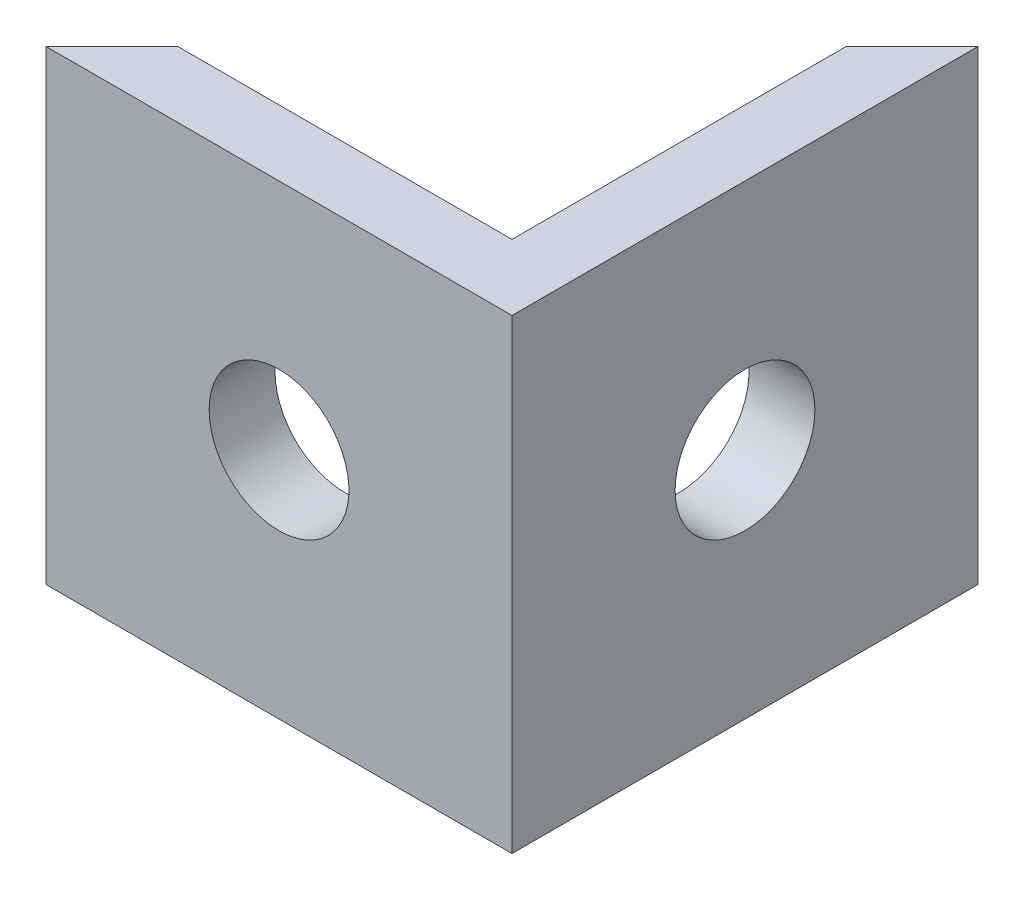
ISO-10303-21;
HEADER;
FILE_DESCRIPTION(('STEP AP214'),'2;1');
FILE_NAME('part.step','',(''),(''),'','','');
FILE_SCHEMA(('AUTOMOTIVE_DESIGN { 1 0 10303 214 1 1 1 1 }'));
ENDSEC;
DATA;
#1=APPLICATION_CONTEXT('core data for automotive mechanical design processes');
#2=APPLICATION_PROTOCOL_DEFINITION('international standard','automotive_design',2000,#1);
#3=PRODUCT_CONTEXT('',#1,'mechanical');
#4=PRODUCT('Part','Part','',(#3));
#5=PRODUCT_RELATED_PRODUCT_CATEGORY('part','',(#4));
#6=PRODUCT_DEFINITION_FORMATION('','',#4);
#7=PRODUCT_DEFINITION_CONTEXT('part definition',#1,'design');
#8=PRODUCT_DEFINITION('design','',#6,#7);
#9=PRODUCT_DEFINITION_SHAPE('','',#8);
#10=(LENGTH_UNIT() NAMED_UNIT(*) SI_UNIT(.MILLI.,.METRE.));
#11=(NAMED_UNIT(*) PLANE_ANGLE_UNIT() SI_UNIT($,.RADIAN.));
#12=(NAMED_UNIT(*) SI_UNIT($,.STERADIAN.) SOLID_ANGLE_UNIT());
#13=UNCERTAINTY_MEASURE_WITH_UNIT(LENGTH_MEASURE(1.E-05),#10,'distance_accuracy_value','');
#14=(GEOMETRIC_REPRESENTATION_CONTEXT(3) GLOBAL_UNCERTAINTY_ASSIGNED_CONTEXT((#13)) GLOBAL_UNIT_ASSIGNED_CONTEXT((#10,
#11,#12)) REPRESENTATION_CONTEXT('',''));
#15=CARTESIAN_POINT('',(0.,0.,0.));
#16=DIRECTION('',(0.,0.,1.));
#17=DIRECTION('',(1.,0.,0.));
#18=AXIS2_PLACEMENT_3D('',#15,#16,#17);
#19=CARTESIAN_POINT('',(-18.6404854523969,0.,22.2856381463383));
#20=DIRECTION('',(0.707106781186548,0.,0.707106781186548));
#21=DIRECTION('',(0.707106781186548,0.,-0.707106781186548));
#22=AXIS2_PLACEMENT_3D('',#19,#20,#21);
#23=PLANE('',#22);
#24=DIRECTION('',(0.,1.,0.));
#25=VECTOR('',#24,1.);
#26=CARTESIAN_POINT('',(-27.2262718900238,0.,30.8714245839653));
#27=LINE('',#26,#25);
#28=CARTESIAN_POINT('',(-27.2262718900238,0.,30.8714245839653));
#29=VERTEX_POINT('',#28);
#30=CARTESIAN_POINT('',(-27.2262718900238,10.,30.8714245839653));
#31=VERTEX_POINT('',#30);
#32=EDGE_CURVE('E47',#29,#31,#27,.T.);
#33=ORIENTED_EDGE('',*,*,#32,.F.);
#34=DIRECTION('',(0.707106781186548,0.,-0.707106781186548));
#35=VECTOR('',#34,1.);
#36=CARTESIAN_POINT('',(-18.6404854523969,0.,22.2856381463383));
#37=LINE('',#36,#35);
#38=CARTESIAN_POINT('',(-28.6404854523969,0.,32.2856381463383));
#39=VERTEX_POINT('',#38);
#40=EDGE_CURVE('E83',#39,#29,#37,.T.);
#41=ORIENTED_EDGE('',*,*,#40,.F.);
#42=DIRECTION('',(0.,-1.,0.));
#43=VECTOR('',#42,1.);
#44=CARTESIAN_POINT('',(-28.6404854523969,10.,32.2856381463383));
#45=LINE('',#44,#43);
#46=CARTESIAN_POINT('',(-28.6404854523969,10.,32.2856381463383));
#47=VERTEX_POINT('',#46);
#48=EDGE_CURVE('E91',#47,#39,#45,.T.);
#49=ORIENTED_EDGE('',*,*,#48,.F.);
#50=DIRECTION('',(0.707106781186548,0.,-0.707106781186548));
#51=VECTOR('',#50,1.);
#52=CARTESIAN_POINT('',(-18.6404854523969,10.,22.2856381463383));
#53=LINE('',#52,#51);
#54=EDGE_CURVE('E131',#47,#31,#53,.T.);
#55=ORIENTED_EDGE('',*,*,#54,.T.);
#56=EDGE_LOOP('',(#33,#41,#49,#55));
#57=FACE_BOUND('',#56,.T.);
#58=ADVANCED_FACE('F39',(#57),#23,.F.);
#59=CARTESIAN_POINT('',(-28.6404854523969,10.,32.2856381463383));
#60=DIRECTION('',(0.,0.,-1.));
#61=DIRECTION('',(-1.,0.,0.));
#62=AXIS2_PLACEMENT_3D('',#59,#60,#61);
#63=PLANE('',#62);
#64=CARTESIAN_POINT('',(-23.6404854523969,5.,32.2856381463383));
#65=DIRECTION('',(0.,0.,-1.));
#66=DIRECTION('',(-1.,0.,0.));
#67=AXIS2_PLACEMENT_3D('',#64,#65,#66);
#68=CIRCLE('',#67,1.5);
#69=CARTESIAN_POINT('',(-25.1404854523969,5.,32.2856381463383));
#70=VERTEX_POINT('',#69);
#71=EDGE_CURVE('E176',#70,#70,#68,.T.);
#72=ORIENTED_EDGE('',*,*,#71,.T.);
#73=EDGE_LOOP('',(#72));
#74=FACE_BOUND('',#73,.T.);
#75=DIRECTION('',(1.,0.,0.));
#76=VECTOR('',#75,1.);
#77=CARTESIAN_POINT('',(-28.6404854523969,0.,32.2856381463383));
#78=LINE('',#77,#76);
#79=CARTESIAN_POINT('',(-18.6404854523969,0.,32.2856381463383));
#80=VERTEX_POINT('',#79);
#81=EDGE_CURVE('E129',#39,#80,#78,.T.);
#82=ORIENTED_EDGE('',*,*,#81,.T.);
#83=DIRECTION('',(0.,-1.,0.));
#84=VECTOR('',#83,1.);
#85=CARTESIAN_POINT('',(-18.6404854523969,10.,32.2856381463383));
#86=LINE('',#85,#84);
#87=CARTESIAN_POINT('',(-18.6404854523969,10.,32.2856381463383));
#88=VERTEX_POINT('',#87);
#89=EDGE_CURVE('E76',#88,#80,#86,.T.);
#90=ORIENTED_EDGE('',*,*,#89,.F.);
#91=DIRECTION('',(1.,0.,0.));
#92=VECTOR('',#91,1.);
#93=CARTESIAN_POINT('',(-28.6404854523969,10.,32.2856381463383));
#94=LINE('',#93,#92);
#95=EDGE_CURVE('E63',#47,#88,#94,.T.);
#96=ORIENTED_EDGE('',*,*,#95,.F.);
#97=ORIENTED_EDGE('',*,*,#48,.T.);
#98=EDGE_LOOP('',(#82,#90,#96,#97));
#99=FACE_BOUND('',#98,.T.);
#100=ADVANCED_FACE('F41',(#74,#99),#63,.F.);
#101=CARTESIAN_POINT('',(-18.6404854523969,10.,22.2856381463383));
#102=DIRECTION('',(1.,0.,0.));
#103=DIRECTION('',(0.,0.,-1.));
#104=AXIS2_PLACEMENT_3D('',#101,#102,#103);
#105=PLANE('',#104);
#106=CARTESIAN_POINT('',(-18.6404854523969,5.,27.2856381463384));
#107=DIRECTION('',(1.,0.,0.));
#108=DIRECTION('',(0.,0.,-1.));
#109=AXIS2_PLACEMENT_3D('',#106,#107,#108);
#110=CIRCLE('',#109,1.5);
#111=CARTESIAN_POINT('',(-18.6404854523969,5.,25.7856381463383));
#112=VERTEX_POINT('',#111);
#113=EDGE_CURVE('E124',#112,#112,#110,.T.);
#114=ORIENTED_EDGE('',*,*,#113,.F.);
#115=EDGE_LOOP('',(#114));
#116=FACE_BOUND('',#115,.T.);
#117=DIRECTION('',(0.,0.,1.));
#118=VECTOR('',#117,1.);
#119=CARTESIAN_POINT('',(-18.6404854523969,0.,22.2856381463383));
#120=LINE('',#119,#118);
#121=CARTESIAN_POINT('',(-18.6404854523969,0.,22.2856381463383));
#122=VERTEX_POINT('',#121);
#123=EDGE_CURVE('E135',#122,#80,#120,.T.);
#124=ORIENTED_EDGE('',*,*,#123,.F.);
#125=DIRECTION('',(0.,-1.,0.));
#126=VECTOR('',#125,1.);
#127=CARTESIAN_POINT('',(-18.6404854523969,10.,22.2856381463383));
#128=LINE('',#127,#126);
#129=CARTESIAN_POINT('',(-18.6404854523969,10.,22.2856381463383));
#130=VERTEX_POINT('',#129);
#131=EDGE_CURVE('E141',#130,#122,#128,.T.);
#132=ORIENTED_EDGE('',*,*,#131,.F.);
#133=DIRECTION('',(0.,0.,1.));
#134=VECTOR('',#133,1.);
#135=CARTESIAN_POINT('',(-18.6404854523969,10.,22.2856381463383));
#136=LINE('',#135,#134);
#137=EDGE_CURVE('E134',#130,#88,#136,.T.);
#138=ORIENTED_EDGE('',*,*,#137,.T.);
#139=ORIENTED_EDGE('',*,*,#89,.T.);
#140=EDGE_LOOP('',(#124,#132,#138,#139));
#141=FACE_BOUND('',#140,.T.);
#142=ADVANCED_FACE('F153',(#116,#141),#105,.T.);
#143=CARTESIAN_POINT('',(0.,10.,0.));
#144=DIRECTION('',(0.,-1.,0.));
#145=DIRECTION('',(0.,0.,-1.));
#146=AXIS2_PLACEMENT_3D('',#143,#144,#145);
#147=PLANE('',#146);
#148=CARTESIAN_POINT('',(-20.05469901477,10.,23.6998517087114));
#149=VERTEX_POINT('',#148);
#150=EDGE_CURVE('E112',#149,#130,#53,.T.);
#151=ORIENTED_EDGE('',*,*,#150,.F.);
#152=DIRECTION('',(0.,0.,-1.));
#153=VECTOR('',#152,1.);
#154=CARTESIAN_POINT('',(-20.05469901477,10.,30.8714245839653));
#155=LINE('',#154,#153);
#156=CARTESIAN_POINT('',(-20.05469901477,10.,30.8714245839653));
#157=VERTEX_POINT('',#156);
#158=EDGE_CURVE('E101',#157,#149,#155,.T.);
#159=ORIENTED_EDGE('',*,*,#158,.F.);
#160=DIRECTION('',(-1.,0.,0.));
#161=VECTOR('',#160,1.);
#162=CARTESIAN_POINT('',(-20.05469901477,10.,30.8714245839653));
#163=LINE('',#162,#161);
#164=EDGE_CURVE('E111',#157,#31,#163,.T.);
#165=ORIENTED_EDGE('',*,*,#164,.T.);
#166=ORIENTED_EDGE('',*,*,#54,.F.);
#167=ORIENTED_EDGE('',*,*,#95,.T.);
#168=ORIENTED_EDGE('',*,*,#137,.F.);
#169=EDGE_LOOP('',(#151,#159,#165,#166,#167,#168));
#170=FACE_BOUND('',#169,.T.);
#171=ADVANCED_FACE('F145',(#170),#147,.F.);
#172=CARTESIAN_POINT('',(0.,0.,0.));
#173=DIRECTION('',(0.,-1.,0.));
#174=DIRECTION('',(0.,0.,-1.));
#175=AXIS2_PLACEMENT_3D('',#172,#173,#174);
#176=PLANE('',#175);
#177=DIRECTION('',(0.,0.,-1.));
#178=VECTOR('',#177,1.);
#179=CARTESIAN_POINT('',(-20.05469901477,0.,30.8714245839653));
#180=LINE('',#179,#178);
#181=CARTESIAN_POINT('',(-20.05469901477,0.,30.8714245839653));
#182=VERTEX_POINT('',#181);
#183=CARTESIAN_POINT('',(-20.05469901477,0.,23.6998517087114));
#184=VERTEX_POINT('',#183);
#185=EDGE_CURVE('E113',#182,#184,#180,.T.);
#186=ORIENTED_EDGE('',*,*,#185,.T.);
#187=EDGE_CURVE('E130',#184,#122,#37,.T.);
#188=ORIENTED_EDGE('',*,*,#187,.T.);
#189=ORIENTED_EDGE('',*,*,#123,.T.);
#190=ORIENTED_EDGE('',*,*,#81,.F.);
#191=ORIENTED_EDGE('',*,*,#40,.T.);
#192=DIRECTION('',(-1.,0.,0.));
#193=VECTOR('',#192,1.);
#194=CARTESIAN_POINT('',(-20.05469901477,0.,30.8714245839653));
#195=LINE('',#194,#193);
#196=EDGE_CURVE('E54',#182,#29,#195,.T.);
#197=ORIENTED_EDGE('',*,*,#196,.F.);
#198=EDGE_LOOP('',(#186,#188,#189,#190,#191,#197));
#199=FACE_BOUND('',#198,.T.);
#200=ADVANCED_FACE('F119',(#199),#176,.T.);
#201=ORIENTED_EDGE('',*,*,#187,.F.);
#202=DIRECTION('',(0.,1.,0.));
#203=VECTOR('',#202,1.);
#204=CARTESIAN_POINT('',(-20.05469901477,0.,23.6998517087114));
#205=LINE('',#204,#203);
#206=EDGE_CURVE('E11',#184,#149,#205,.T.);
#207=ORIENTED_EDGE('',*,*,#206,.T.);
#208=ORIENTED_EDGE('',*,*,#150,.T.);
#209=ORIENTED_EDGE('',*,*,#131,.T.);
#210=EDGE_LOOP('',(#201,#207,#208,#209));
#211=FACE_BOUND('',#210,.T.);
#212=ADVANCED_FACE('F148',(#211),#23,.F.);
#213=CARTESIAN_POINT('',(-20.05469901477,0.,30.8714245839653));
#214=DIRECTION('',(1.,0.,0.));
#215=DIRECTION('',(0.,0.,-1.));
#216=AXIS2_PLACEMENT_3D('',#213,#214,#215);
#217=PLANE('',#216);
#218=CARTESIAN_POINT('',(-20.05469901477,5.,27.2856381463384));
#219=DIRECTION('',(-1.,0.,0.));
#220=DIRECTION('',(0.,0.,1.));
#221=AXIS2_PLACEMENT_3D('',#218,#219,#220);
#222=CIRCLE('',#221,1.5);
#223=CARTESIAN_POINT('',(-20.05469901477,5.,28.7856381463384));
#224=VERTEX_POINT('',#223);
#225=EDGE_CURVE('E174',#224,#224,#222,.T.);
#226=ORIENTED_EDGE('',*,*,#225,.F.);
#227=EDGE_LOOP('',(#226));
#228=FACE_BOUND('',#227,.T.);
#229=ORIENTED_EDGE('',*,*,#185,.F.);
#230=DIRECTION('',(0.,1.,0.));
#231=VECTOR('',#230,1.);
#232=CARTESIAN_POINT('',(-20.05469901477,0.,30.8714245839653));
#233=LINE('',#232,#231);
#234=EDGE_CURVE('E108',#182,#157,#233,.T.);
#235=ORIENTED_EDGE('',*,*,#234,.T.);
#236=ORIENTED_EDGE('',*,*,#158,.T.);
#237=ORIENTED_EDGE('',*,*,#206,.F.);
#238=EDGE_LOOP('',(#229,#235,#236,#237));
#239=FACE_BOUND('',#238,.T.);
#240=ADVANCED_FACE('F115',(#228,#239),#217,.F.);
#241=CARTESIAN_POINT('',(-20.05469901477,0.,30.8714245839653));
#242=DIRECTION('',(0.,0.,-1.));
#243=DIRECTION('',(-1.,0.,0.));
#244=AXIS2_PLACEMENT_3D('',#241,#242,#243);
#245=PLANE('',#244);
#246=CARTESIAN_POINT('',(-23.6404854523969,5.,30.8714245839653));
#247=DIRECTION('',(0.,0.,-1.));
#248=DIRECTION('',(-1.,0.,0.));
#249=AXIS2_PLACEMENT_3D('',#246,#247,#248);
#250=CIRCLE('',#249,1.5);
#251=CARTESIAN_POINT('',(-25.1404854523969,5.,30.8714245839653));
#252=VERTEX_POINT('',#251);
#253=EDGE_CURVE('E180',#252,#252,#250,.T.);
#254=ORIENTED_EDGE('',*,*,#253,.F.);
#255=EDGE_LOOP('',(#254));
#256=FACE_BOUND('',#255,.T.);
#257=ORIENTED_EDGE('',*,*,#32,.T.);
#258=ORIENTED_EDGE('',*,*,#164,.F.);
#259=ORIENTED_EDGE('',*,*,#234,.F.);
#260=ORIENTED_EDGE('',*,*,#196,.T.);
#261=EDGE_LOOP('',(#257,#258,#259,#260));
#262=FACE_BOUND('',#261,.T.);
#263=ADVANCED_FACE('F109',(#256,#262),#245,.T.);
#264=CARTESIAN_POINT('',(-10.05469901477,5.,27.2856381463384));
#265=DIRECTION('',(-1.,0.,0.));
#266=DIRECTION('',(0.,0.,1.));
#267=AXIS2_PLACEMENT_3D('',#264,#265,#266);
#268=CYLINDRICAL_SURFACE('',#267,1.5);
#269=ORIENTED_EDGE('',*,*,#113,.T.);
#270=EDGE_LOOP('',(#269));
#271=FACE_BOUND('',#270,.T.);
#272=ORIENTED_EDGE('',*,*,#225,.T.);
#273=EDGE_LOOP('',(#272));
#274=FACE_BOUND('',#273,.T.);
#275=ADVANCED_FACE('F190',(#271,#274),#268,.F.);
#276=CARTESIAN_POINT('',(-23.6404854523969,5.,40.8714245839653));
#277=DIRECTION('',(0.,0.,-1.));
#278=DIRECTION('',(-1.,0.,0.));
#279=AXIS2_PLACEMENT_3D('',#276,#277,#278);
#280=CYLINDRICAL_SURFACE('',#279,1.5);
#281=ORIENTED_EDGE('',*,*,#253,.T.);
#282=EDGE_LOOP('',(#281));
#283=FACE_BOUND('',#282,.T.);
#284=ORIENTED_EDGE('',*,*,#71,.F.);
#285=EDGE_LOOP('',(#284));
#286=FACE_BOUND('',#285,.T.);
#287=ADVANCED_FACE('F186',(#283,#286),#280,.F.);
#288=CLOSED_SHELL('',(#58,#100,#142,#171,#200,#212,#240,#263,#275,#287));
#289=MANIFOLD_SOLID_BREP('B2',#288);
#290=ADVANCED_BREP_SHAPE_REPRESENTATION('',(#18,#289),#14);
#291=SHAPE_DEFINITION_REPRESENTATION(#9,#290);
ENDSEC;
END-ISO-10303-21;
